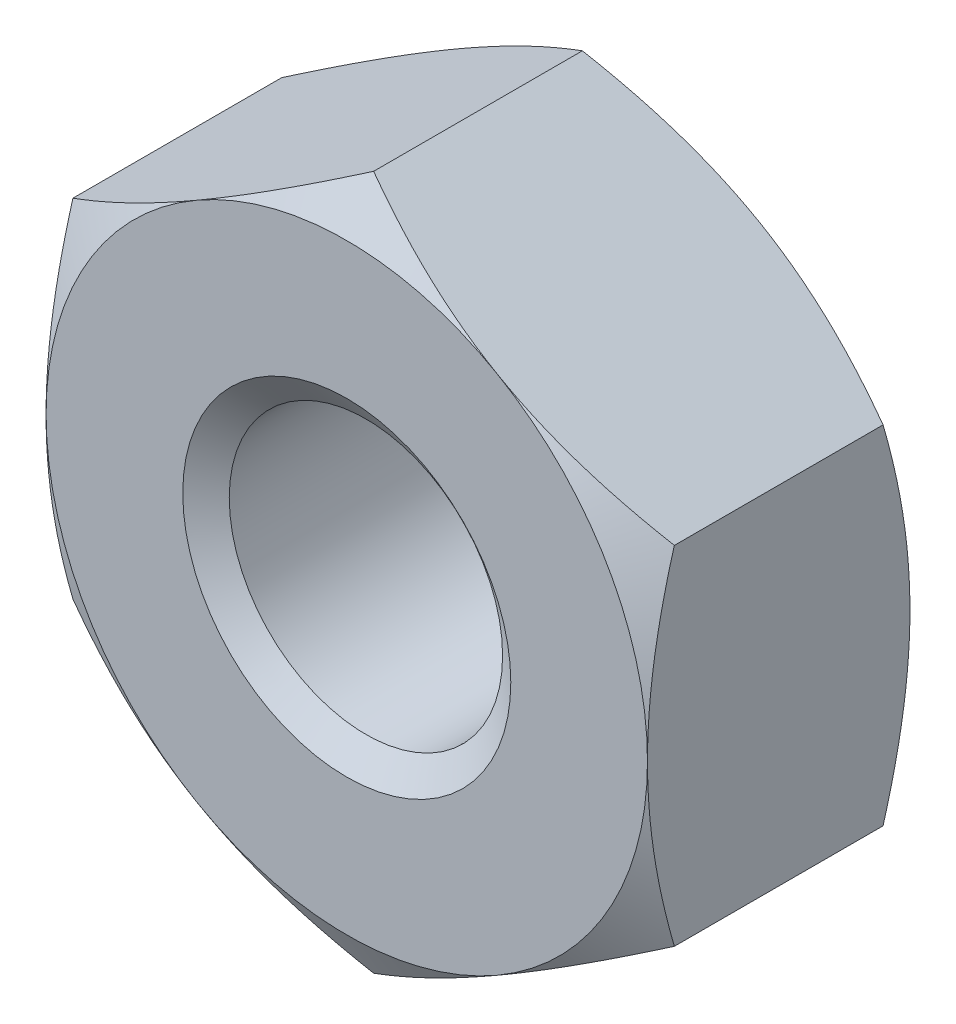
ISO-10303-21;
HEADER;
FILE_DESCRIPTION(('STEP AP214'),'2;1');
FILE_NAME('part.step','',(''),(''),'','','');
FILE_SCHEMA(('AUTOMOTIVE_DESIGN { 1 0 10303 214 1 1 1 1 }'));
ENDSEC;
DATA;
#1=APPLICATION_CONTEXT('core data for automotive mechanical design processes');
#2=APPLICATION_PROTOCOL_DEFINITION('international standard','automotive_design',2000,#1);
#3=PRODUCT_CONTEXT('',#1,'mechanical');
#4=PRODUCT('Part','Part','',(#3));
#5=PRODUCT_RELATED_PRODUCT_CATEGORY('part','',(#4));
#6=PRODUCT_DEFINITION_FORMATION('','',#4);
#7=PRODUCT_DEFINITION_CONTEXT('part definition',#1,'design');
#8=PRODUCT_DEFINITION('design','',#6,#7);
#9=PRODUCT_DEFINITION_SHAPE('','',#8);
#10=(LENGTH_UNIT() NAMED_UNIT(*) SI_UNIT(.MILLI.,.METRE.));
#11=(NAMED_UNIT(*) PLANE_ANGLE_UNIT() SI_UNIT($,.RADIAN.));
#12=(NAMED_UNIT(*) SI_UNIT($,.STERADIAN.) SOLID_ANGLE_UNIT());
#13=UNCERTAINTY_MEASURE_WITH_UNIT(LENGTH_MEASURE(1.E-05),#10,'distance_accuracy_value','');
#14=(GEOMETRIC_REPRESENTATION_CONTEXT(3) GLOBAL_UNCERTAINTY_ASSIGNED_CONTEXT((#13)) GLOBAL_UNIT_ASSIGNED_CONTEXT((#10,
#11,#12)) REPRESENTATION_CONTEXT('',''));
#15=CARTESIAN_POINT('',(0.,0.,0.));
#16=DIRECTION('',(0.,0.,1.));
#17=DIRECTION('',(1.,0.,0.));
#18=AXIS2_PLACEMENT_3D('',#15,#16,#17);
#19=CARTESIAN_POINT('',(0.,0.,-2.4));
#20=DIRECTION('',(0.,0.,1.));
#21=DIRECTION('',(1.,0.,0.));
#22=AXIS2_PLACEMENT_3D('',#19,#20,#21);
#23=CYLINDRICAL_SURFACE('',#22,1.25);
#24=CARTESIAN_POINT('',(0.,0.,-0.175051884552423));
#25=DIRECTION('',(0.,0.,1.));
#26=DIRECTION('',(1.,0.,0.));
#27=AXIS2_PLACEMENT_3D('',#24,#25,#26);
#28=CIRCLE('',#27,1.25);
#29=CARTESIAN_POINT('',(1.25,0.,-0.175051884552423));
#30=VERTEX_POINT('',#29);
#31=EDGE_CURVE('E170',#30,#30,#28,.F.);
#32=ORIENTED_EDGE('',*,*,#31,.F.);
#33=EDGE_LOOP('',(#32));
#34=FACE_BOUND('',#33,.T.);
#35=CARTESIAN_POINT('',(0.,0.,-2.19954811544758));
#36=DIRECTION('',(0.,0.,-1.));
#37=DIRECTION('',(-1.,0.,0.));
#38=AXIS2_PLACEMENT_3D('',#35,#36,#37);
#39=CIRCLE('',#38,1.25);
#40=CARTESIAN_POINT('',(-1.25,0.,-2.19954811544758));
#41=VERTEX_POINT('',#40);
#42=EDGE_CURVE('E35',#41,#41,#39,.F.);
#43=ORIENTED_EDGE('',*,*,#42,.F.);
#44=EDGE_LOOP('',(#43));
#45=FACE_BOUND('',#44,.T.);
#46=ADVANCED_FACE('F30',(#34,#45),#23,.F.);
#47=CARTESIAN_POINT('',(0.,3.17542648054295,-2.4));
#48=DIRECTION('',(0.,0.,-1.));
#49=DIRECTION('',(-1.,0.,0.));
#50=AXIS2_PLACEMENT_3D('',#47,#48,#49);
#51=PLANE('',#50);
#52=CARTESIAN_POINT('',(0.,0.,-2.4));
#53=DIRECTION('',(0.,0.,-1.));
#54=DIRECTION('',(-1.,0.,0.));
#55=AXIS2_PLACEMENT_3D('',#52,#53,#54);
#56=CIRCLE('',#55,2.75);
#57=CARTESIAN_POINT('',(-2.75,0.,-2.4));
#58=VERTEX_POINT('',#57);
#59=CARTESIAN_POINT('',(-1.37500000000002,-2.3815698604072,-2.4));
#60=VERTEX_POINT('',#59);
#61=EDGE_CURVE('E166',#58,#60,#56,.F.);
#62=ORIENTED_EDGE('',*,*,#61,.F.);
#63=CARTESIAN_POINT('',(-1.37500000000001,2.3815698604072,-2.4));
#64=VERTEX_POINT('',#63);
#65=EDGE_CURVE('E148',#64,#58,#56,.F.);
#66=ORIENTED_EDGE('',*,*,#65,.F.);
#67=CARTESIAN_POINT('',(1.37500000000002,2.38156986040719,-2.4));
#68=VERTEX_POINT('',#67);
#69=EDGE_CURVE('E165',#68,#64,#56,.F.);
#70=ORIENTED_EDGE('',*,*,#69,.F.);
#71=CARTESIAN_POINT('',(0.,0.,-2.4));
#72=DIRECTION('',(0.,0.,1.));
#73=DIRECTION('',(1.,0.,0.));
#74=AXIS2_PLACEMENT_3D('',#71,#72,#73);
#75=CIRCLE('',#74,2.75);
#76=CARTESIAN_POINT('',(2.75,0.,-2.4));
#77=VERTEX_POINT('',#76);
#78=EDGE_CURVE('E240',#77,#68,#75,.T.);
#79=ORIENTED_EDGE('',*,*,#78,.F.);
#80=CARTESIAN_POINT('',(1.375,-2.3815698604072,-2.4));
#81=VERTEX_POINT('',#80);
#82=EDGE_CURVE('E356',#81,#77,#56,.F.);
#83=ORIENTED_EDGE('',*,*,#82,.F.);
#84=EDGE_CURVE('E360',#60,#81,#56,.F.);
#85=ORIENTED_EDGE('',*,*,#84,.F.);
#86=EDGE_LOOP('',(#62,#66,#70,#79,#83,#85));
#87=FACE_BOUND('',#86,.T.);
#88=CARTESIAN_POINT('',(0.,0.,-2.4));
#89=DIRECTION('',(0.,0.,-1.));
#90=DIRECTION('',(-1.,0.,0.));
#91=AXIS2_PLACEMENT_3D('',#88,#89,#90);
#92=CIRCLE('',#91,1.5);
#93=CARTESIAN_POINT('',(-1.5,0.,-2.4));
#94=VERTEX_POINT('',#93);
#95=EDGE_CURVE('E173',#94,#94,#92,.F.);
#96=ORIENTED_EDGE('',*,*,#95,.T.);
#97=EDGE_LOOP('',(#96));
#98=FACE_BOUND('',#97,.T.);
#99=ADVANCED_FACE('F293',(#87,#98),#51,.T.);
#100=CARTESIAN_POINT('',(0.,3.17542648054295,0.));
#101=DIRECTION('',(0.,0.,-1.));
#102=DIRECTION('',(-1.,0.,0.));
#103=AXIS2_PLACEMENT_3D('',#100,#101,#102);
#104=PLANE('',#103);
#105=CARTESIAN_POINT('',(0.,0.,0.));
#106=DIRECTION('',(0.,0.,-1.));
#107=DIRECTION('',(-1.,0.,0.));
#108=AXIS2_PLACEMENT_3D('',#105,#106,#107);
#109=CIRCLE('',#108,2.75);
#110=CARTESIAN_POINT('',(-2.75,0.,0.));
#111=VERTEX_POINT('',#110);
#112=CARTESIAN_POINT('',(-1.37500000000001,2.3815698604072,0.));
#113=VERTEX_POINT('',#112);
#114=EDGE_CURVE('E11',#111,#113,#109,.T.);
#115=ORIENTED_EDGE('',*,*,#114,.F.);
#116=CARTESIAN_POINT('',(-1.37500000000002,-2.3815698604072,0.));
#117=VERTEX_POINT('',#116);
#118=EDGE_CURVE('E42',#117,#111,#109,.T.);
#119=ORIENTED_EDGE('',*,*,#118,.F.);
#120=CARTESIAN_POINT('',(1.375,-2.3815698604072,0.));
#121=VERTEX_POINT('',#120);
#122=EDGE_CURVE('E169',#121,#117,#109,.T.);
#123=ORIENTED_EDGE('',*,*,#122,.F.);
#124=CARTESIAN_POINT('',(2.75,0.,0.));
#125=VERTEX_POINT('',#124);
#126=EDGE_CURVE('E347',#125,#121,#109,.T.);
#127=ORIENTED_EDGE('',*,*,#126,.F.);
#128=CARTESIAN_POINT('',(0.,0.,0.));
#129=DIRECTION('',(0.,0.,1.));
#130=DIRECTION('',(1.,0.,0.));
#131=AXIS2_PLACEMENT_3D('',#128,#129,#130);
#132=CIRCLE('',#131,2.75);
#133=CARTESIAN_POINT('',(1.37500000000002,2.38156986040719,0.));
#134=VERTEX_POINT('',#133);
#135=EDGE_CURVE('E124',#125,#134,#132,.T.);
#136=ORIENTED_EDGE('',*,*,#135,.T.);
#137=EDGE_CURVE('E40',#113,#134,#109,.T.);
#138=ORIENTED_EDGE('',*,*,#137,.F.);
#139=EDGE_LOOP('',(#115,#119,#123,#127,#136,#138));
#140=FACE_BOUND('',#139,.T.);
#141=CARTESIAN_POINT('',(0.,0.,0.));
#142=DIRECTION('',(0.,0.,1.));
#143=DIRECTION('',(1.,0.,0.));
#144=AXIS2_PLACEMENT_3D('',#141,#142,#143);
#145=CIRCLE('',#144,1.5);
#146=CARTESIAN_POINT('',(1.5,0.,0.));
#147=VERTEX_POINT('',#146);
#148=EDGE_CURVE('E172',#147,#147,#145,.T.);
#149=ORIENTED_EDGE('',*,*,#148,.F.);
#150=EDGE_LOOP('',(#149));
#151=FACE_BOUND('',#150,.T.);
#152=ADVANCED_FACE('F245',(#140,#151),#104,.F.);
#153=CARTESIAN_POINT('',(0.,3.17542648054295,-2.4));
#154=DIRECTION('',(-0.500000000000004,0.866025403784436,0.));
#155=DIRECTION('',(-0.866025403784437,-0.500000000000004,0.));
#156=AXIS2_PLACEMENT_3D('',#153,#154,#155);
#157=PLANE('',#156);
#158=DIRECTION('',(0.,0.,1.));
#159=VECTOR('',#158,1.);
#160=CARTESIAN_POINT('',(-2.75,1.58771324027146,-2.4));
#161=LINE('',#160,#159);
#162=CARTESIAN_POINT('',(-2.75,1.58771324027149,-2.15437990693813));
#163=VERTEX_POINT('',#162);
#164=CARTESIAN_POINT('',(-2.75,1.58771324027146,-0.24562009306186));
#165=VERTEX_POINT('',#164);
#166=EDGE_CURVE('E160',#163,#165,#161,.T.);
#167=ORIENTED_EDGE('',*,*,#166,.T.);
#168=CARTESIAN_POINT('',(-2.7502,1.58759777021762,-0.245686763364758));
#169=CARTESIAN_POINT('',(-2.62935077934009,1.65737010029698,-0.205387662249261));
#170=CARTESIAN_POINT('',(-2.50745839737737,1.72774469983532,-0.16873690259766));
#171=CARTESIAN_POINT('',(-2.26156287327211,1.86971254687002,-0.104762182969798));
#172=CARTESIAN_POINT('',(-2.13755536142615,1.94130831721582,-0.0774608556744949));
#173=CARTESIAN_POINT('',(-1.89107720202406,2.08361254889598,-0.0349617452941145));
#174=CARTESIAN_POINT('',(-1.76864448141259,2.15429911309863,-0.0194811186224557));
#175=CARTESIAN_POINT('',(-1.52320285763109,2.29600490065922,-0.00099939736993867));
#176=CARTESIAN_POINT('',(-1.40019484676709,2.36702360884403,0.00201700053740198));
#177=CARTESIAN_POINT('',(-1.17034121338921,2.49972966594897,-0.0042531454285454));
#178=CARTESIAN_POINT('',(-1.06346120874598,2.56143686540072,-0.0120001542767015));
#179=CARTESIAN_POINT('',(-0.85039753266525,2.68444923614047,-0.0365551810643548));
#180=CARTESIAN_POINT('',(-0.744214598351109,2.74575398185008,-0.0533715896505709));
#181=CARTESIAN_POINT('',(-0.530711510606813,2.86902004703207,-0.0954119223459583));
#182=CARTESIAN_POINT('',(-0.42341838385714,2.93096576264319,-0.120814080687234));
#183=CARTESIAN_POINT('',(-0.210432520715942,3.05393320806134,-0.178467225839987));
#184=CARTESIAN_POINT('',(-0.104737054973339,3.11495651365996,-0.210704663298988));
#185=CARTESIAN_POINT('',(0.000200000000008958,3.17554195059679,-0.245686763364767));
#186=B_SPLINE_CURVE_WITH_KNOTS('',3,(#168,#169,#170,#171,#172,#173,#174,#175,#176,#177,#178,
#179,#180,#181,#182,#183,#184,#185),.UNSPECIFIED.,.F.,.F.,(4,2,2,2,2,2,2,2,4),(0.,
0.435912828725888,0.872873557116331,1.29901931904671,1.72464171213573,2.09526089052938,
2.46622354066375,2.84541551798559,3.22386274754526),.UNSPECIFIED.);
#187=EDGE_CURVE('E129',#165,#113,#186,.T.);
#188=ORIENTED_EDGE('',*,*,#187,.T.);
#189=CARTESIAN_POINT('',(0.,3.17542648054295,-0.245620093061869));
#190=VERTEX_POINT('',#189);
#191=EDGE_CURVE('E49',#113,#190,#186,.T.);
#192=ORIENTED_EDGE('',*,*,#191,.T.);
#193=DIRECTION('',(0.,0.,1.));
#194=VECTOR('',#193,1.);
#195=CARTESIAN_POINT('',(0.,3.17542648054295,-2.4));
#196=LINE('',#195,#194);
#197=CARTESIAN_POINT('',(0.,3.17542648054295,-2.15437990693813));
#198=VERTEX_POINT('',#197);
#199=EDGE_CURVE('E145',#198,#190,#196,.T.);
#200=ORIENTED_EDGE('',*,*,#199,.F.);
#201=CARTESIAN_POINT('',(-2.7502,1.58759777021762,-2.15431323663524));
#202=CARTESIAN_POINT('',(-2.62935077934009,1.65737010029698,-2.19461233775074));
#203=CARTESIAN_POINT('',(-2.50745839737737,1.72774469983532,-2.23126309740234));
#204=CARTESIAN_POINT('',(-2.26156287327211,1.86971254687002,-2.2952378170302));
#205=CARTESIAN_POINT('',(-2.13755536142615,1.94130831721582,-2.3225391443255));
#206=CARTESIAN_POINT('',(-1.89107720202406,2.08361254889598,-2.36503825470589));
#207=CARTESIAN_POINT('',(-1.76864448141259,2.15429911309863,-2.38051888137754));
#208=CARTESIAN_POINT('',(-1.52320285763109,2.29600490065922,-2.39900060263006));
#209=CARTESIAN_POINT('',(-1.40019484676709,2.36702360884403,-2.4020170005374));
#210=CARTESIAN_POINT('',(-1.17034121338921,2.49972966594897,-2.39574685457145));
#211=CARTESIAN_POINT('',(-1.06346120874598,2.56143686540072,-2.3879998457233));
#212=CARTESIAN_POINT('',(-0.85039753266525,2.68444923614047,-2.36344481893564));
#213=CARTESIAN_POINT('',(-0.744214598351109,2.74575398185008,-2.34662841034943));
#214=CARTESIAN_POINT('',(-0.530711510606812,2.86902004703207,-2.30458807765404));
#215=CARTESIAN_POINT('',(-0.42341838385714,2.93096576264319,-2.27918591931277));
#216=CARTESIAN_POINT('',(-0.210432520715942,3.05393320806134,-2.22153277416001));
#217=CARTESIAN_POINT('',(-0.104737054973339,3.11495651365996,-2.18929533670101));
#218=CARTESIAN_POINT('',(0.000200000000008958,3.17554195059679,-2.15431323663523));
#219=B_SPLINE_CURVE_WITH_KNOTS('',3,(#201,#202,#203,#204,#205,#206,#207,#208,#209,#210,#211,
#212,#213,#214,#215,#216,#217,#218),.UNSPECIFIED.,.F.,.F.,(4,2,2,2,2,2,2,2,4),(0.,
0.435912828725888,0.872873557116331,1.29901931904671,1.72464171213573,2.09526089052938,
2.46622354066375,2.84541551798559,3.22386274754526),.UNSPECIFIED.);
#220=EDGE_CURVE('E163',#64,#198,#219,.T.);
#221=ORIENTED_EDGE('',*,*,#220,.F.);
#222=EDGE_CURVE('E255',#163,#64,#219,.T.);
#223=ORIENTED_EDGE('',*,*,#222,.F.);
#224=EDGE_LOOP('',(#167,#188,#192,#200,#221,#223));
#225=FACE_BOUND('',#224,.T.);
#226=ADVANCED_FACE('F32',(#225),#157,.T.);
#227=CARTESIAN_POINT('',(2.75,1.58771324027145,-2.4));
#228=DIRECTION('',(0.500000000000009,0.866025403784433,0.));
#229=DIRECTION('',(-0.866025403784434,0.500000000000009,0.));
#230=AXIS2_PLACEMENT_3D('',#227,#228,#229);
#231=PLANE('',#230);
#232=ORIENTED_EDGE('',*,*,#199,.T.);
#233=CARTESIAN_POINT('',(-0.000199999999990853,3.17554195059679,-0.245686763364767));
#234=CARTESIAN_POINT('',(0.120649220659915,3.10576962051744,-0.20538766224927));
#235=CARTESIAN_POINT('',(0.242541602622642,3.03539502097909,-0.168736902597668));
#236=CARTESIAN_POINT('',(0.4884371267279,2.89342717394439,-0.104762182969804));
#237=CARTESIAN_POINT('',(0.612444638573863,2.82183140359859,-0.0774608556744999));
#238=CARTESIAN_POINT('',(0.85892279797595,2.67952717191842,-0.0349617452941177));
#239=CARTESIAN_POINT('',(0.981355518587424,2.60884060771577,-0.0194811186224581));
#240=CARTESIAN_POINT('',(1.22679714236892,2.46713482015518,-0.000999397369939279));
#241=CARTESIAN_POINT('',(1.34980515323292,2.39611611197037,0.00201700053740233));
#242=CARTESIAN_POINT('',(1.5796587866108,2.26341005486543,-0.00425314542854367));
#243=CARTESIAN_POINT('',(1.68653879125403,2.20170285541368,-0.0120001542766991));
#244=CARTESIAN_POINT('',(1.89960246733475,2.07869048467393,-0.036555181064351));
#245=CARTESIAN_POINT('',(2.00578540164889,2.01738573896432,-0.0533715896505663));
#246=CARTESIAN_POINT('',(2.21928848939319,1.89411967378233,-0.0954119223459519));
#247=CARTESIAN_POINT('',(2.32658161614286,1.83217395817121,-0.120814080687226));
#248=CARTESIAN_POINT('',(2.53956747928405,1.70920651275305,-0.178467225839977));
#249=CARTESIAN_POINT('',(2.64526294502666,1.64818320715444,-0.210704663298978));
#250=CARTESIAN_POINT('',(2.7502,1.58759777021761,-0.245686763364756));
#251=B_SPLINE_CURVE_WITH_KNOTS('',3,(#233,#234,#235,#236,#237,#238,#239,#240,#241,#242,#243,
#244,#245,#246,#247,#248,#249,#250),.UNSPECIFIED.,.F.,.F.,(4,2,2,2,2,2,2,2,4),(0.,
0.43591282872589,0.872873557116336,1.29901931904672,1.72464171213574,2.09526089052938,
2.46622354066375,2.84541551798558,3.22386274754526),.UNSPECIFIED.);
#252=EDGE_CURVE('E139',#190,#134,#251,.T.);
#253=ORIENTED_EDGE('',*,*,#252,.T.);
#254=CARTESIAN_POINT('',(2.75,1.58771324027149,-0.245620093061869));
#255=VERTEX_POINT('',#254);
#256=EDGE_CURVE('E56',#134,#255,#251,.T.);
#257=ORIENTED_EDGE('',*,*,#256,.T.);
#258=DIRECTION('',(0.,0.,1.));
#259=VECTOR('',#258,1.);
#260=CARTESIAN_POINT('',(2.75,1.58771324027145,-2.4));
#261=LINE('',#260,#259);
#262=CARTESIAN_POINT('',(2.75,1.58771324027149,-2.15437990693813));
#263=VERTEX_POINT('',#262);
#264=EDGE_CURVE('E138',#263,#255,#261,.T.);
#265=ORIENTED_EDGE('',*,*,#264,.F.);
#266=CARTESIAN_POINT('',(-0.000199999999990853,3.17554195059679,-2.15431323663523));
#267=CARTESIAN_POINT('',(0.120649220659915,3.10576962051743,-2.19461233775073));
#268=CARTESIAN_POINT('',(0.242541602622642,3.03539502097909,-2.23126309740233));
#269=CARTESIAN_POINT('',(0.4884371267279,2.89342717394439,-2.29523781703019));
#270=CARTESIAN_POINT('',(0.612444638573863,2.82183140359859,-2.3225391443255));
#271=CARTESIAN_POINT('',(0.85892279797595,2.67952717191842,-2.36503825470588));
#272=CARTESIAN_POINT('',(0.981355518587423,2.60884060771577,-2.38051888137754));
#273=CARTESIAN_POINT('',(1.22679714236892,2.46713482015518,-2.39900060263006));
#274=CARTESIAN_POINT('',(1.34980515323292,2.39611611197037,-2.4020170005374));
#275=CARTESIAN_POINT('',(1.5796587866108,2.26341005486543,-2.39574685457146));
#276=CARTESIAN_POINT('',(1.68653879125403,2.20170285541368,-2.3879998457233));
#277=CARTESIAN_POINT('',(1.89960246733475,2.07869048467393,-2.36344481893565));
#278=CARTESIAN_POINT('',(2.00578540164889,2.01738573896432,-2.34662841034943));
#279=CARTESIAN_POINT('',(2.21928848939319,1.89411967378233,-2.30458807765405));
#280=CARTESIAN_POINT('',(2.32658161614286,1.83217395817121,-2.27918591931277));
#281=CARTESIAN_POINT('',(2.53956747928405,1.70920651275305,-2.22153277416002));
#282=CARTESIAN_POINT('',(2.64526294502666,1.64818320715444,-2.18929533670102));
#283=CARTESIAN_POINT('',(2.7502,1.58759777021761,-2.15431323663524));
#284=B_SPLINE_CURVE_WITH_KNOTS('',3,(#266,#267,#268,#269,#270,#271,#272,#273,#274,#275,#276,
#277,#278,#279,#280,#281,#282,#283),.UNSPECIFIED.,.F.,.F.,(4,2,2,2,2,2,2,2,4),(0.,
0.43591282872589,0.872873557116335,1.29901931904672,1.72464171213574,2.09526089052938,
2.46622354066375,2.84541551798558,3.22386274754526),.UNSPECIFIED.);
#285=EDGE_CURVE('E249',#68,#263,#284,.T.);
#286=ORIENTED_EDGE('',*,*,#285,.F.);
#287=EDGE_CURVE('E254',#198,#68,#284,.T.);
#288=ORIENTED_EDGE('',*,*,#287,.F.);
#289=EDGE_LOOP('',(#232,#253,#257,#265,#286,#288));
#290=FACE_BOUND('',#289,.T.);
#291=ADVANCED_FACE('F136',(#290),#231,.T.);
#292=CARTESIAN_POINT('',(2.75,1.58771324027145,-2.4));
#293=DIRECTION('',(-1.,0.,0.));
#294=DIRECTION('',(0.,0.,1.));
#295=AXIS2_PLACEMENT_3D('',#292,#293,#294);
#296=PLANE('',#295);
#297=CARTESIAN_POINT('',(2.75,-4.2108494930968,-1.31594843960296));
#298=CARTESIAN_POINT('',(2.75,-4.09010894214094,-1.25759993615226));
#299=CARTESIAN_POINT('',(2.75,-3.96908292065513,-1.19983146511761));
#300=CARTESIAN_POINT('',(2.75,-3.72630558284848,-1.08578603842307));
#301=CARTESIAN_POINT('',(2.75,-3.60455414536204,-1.02950934100249));
#302=CARTESIAN_POINT('',(2.75,-3.35951393034358,-0.918482443352777));
#303=CARTESIAN_POINT('',(2.75,-3.2362203423644,-0.863742821605857));
#304=CARTESIAN_POINT('',(2.75,-2.98861980138747,-0.756614777476472));
#305=CARTESIAN_POINT('',(2.75,-2.86431290161186,-0.704226232536781));
#306=CARTESIAN_POINT('',(2.75,-2.61294485887176,-0.60180357214614));
#307=CARTESIAN_POINT('',(2.75,-2.48586863815658,-0.55180625789841));
#308=CARTESIAN_POINT('',(2.75,-2.23021732171544,-0.455727408784616));
#309=CARTESIAN_POINT('',(2.75,-2.10164206103367,-0.409646309576985));
#310=CARTESIAN_POINT('',(2.75,-1.8430521879947,-0.322638077046244));
#311=CARTESIAN_POINT('',(2.75,-1.71304130052587,-0.2816999864139));
#312=CARTESIAN_POINT('',(2.75,-1.45117125062151,-0.206307307624358));
#313=CARTESIAN_POINT('',(2.75,-1.31931268690205,-0.171850669152777));
#314=CARTESIAN_POINT('',(2.75,-1.05365722480015,-0.111093671530912));
#315=CARTESIAN_POINT('',(2.75,-0.91985982021762,-0.0847954840951284));
#316=CARTESIAN_POINT('',(2.75,-0.650651874037408,-0.0421260371966166));
#317=CARTESIAN_POINT('',(2.75,-0.515241331013621,-0.0257547865105478));
#318=CARTESIAN_POINT('',(2.75,-0.244373242869235,-0.00438749654024077));
#319=CARTESIAN_POINT('',(2.75,-0.108921526377157,0.000680556773213337));
#320=CARTESIAN_POINT('',(2.75,0.161887058855111,-0.000827795632673392));
#321=CARTESIAN_POINT('',(2.75,0.297243943089618,-0.00740117868555455));
#322=CARTESIAN_POINT('',(2.75,0.528385436717519,-0.0281041300468435));
#323=CARTESIAN_POINT('',(2.75,0.624425050137477,-0.0395376410301872));
#324=CARTESIAN_POINT('',(2.75,0.815762399811518,-0.0675217196133488));
#325=CARTESIAN_POINT('',(2.75,0.911060016631939,-0.0840730942276795));
#326=CARTESIAN_POINT('',(2.75,1.19576218748913,-0.14053536127828));
#327=CARTESIAN_POINT('',(2.75,1.38383224738493,-0.187239859417288));
#328=CARTESIAN_POINT('',(2.75,1.66525048947482,-0.26779249703057));
#329=CARTESIAN_POINT('',(2.75,1.76006556248554,-0.296803334995492));
#330=CARTESIAN_POINT('',(2.75,1.94870609382212,-0.357695648906578));
#331=CARTESIAN_POINT('',(2.75,2.04253218553692,-0.389575144878493));
#332=CARTESIAN_POINT('',(2.75,2.22880240354981,-0.455541418186437));
#333=CARTESIAN_POINT('',(2.75,2.32125133588448,-0.489614761455521));
#334=CARTESIAN_POINT('',(2.75,2.50543192042625,-0.559761368231096));
#335=CARTESIAN_POINT('',(2.75,2.59716326539575,-0.595835440037304));
#336=CARTESIAN_POINT('',(2.75,2.68856293053342,-0.63271244199747));
#337=B_SPLINE_CURVE_WITH_KNOTS('',3,(#297,#298,#299,#300,#301,#302,#303,#304,#305,#306,#307,
#308,#309,#310,#311,#312,#313,#314,#315,#316,#317,#318,#319,#320,#321,#322,#323,#324,#325,#326,
#327,#328,#329,#330,#331,#332,#333,#334,#335,#336),.UNSPECIFIED.,.F.,.F.,(4,2,2,2,2,2,2,2,2,2,2,
2,2,2,2,2,2,2,2,4),(0.,0.402305607365937,0.804680408536998,1.20935783819118,1.61401414820819,
2.02363838185771,2.4333081245735,2.84208969479601,3.25074173456638,3.65950246109145,
4.06826354901186,4.47441284024652,4.88045669141174,5.17046846817548,5.46052599902454,
6.04107275309884,6.33851131304662,6.63574613017455,6.93130791005792,7.22698998004823),.UNSPECIFIED.);
#338=CARTESIAN_POINT('',(2.74999999999999,-1.58771324027152,-0.245620093061869));
#339=VERTEX_POINT('',#338);
#340=EDGE_CURVE('E131',#339,#125,#337,.T.);
#341=ORIENTED_EDGE('',*,*,#340,.F.);
#342=DIRECTION('',(0.,0.,1.));
#343=VECTOR('',#342,1.);
#344=CARTESIAN_POINT('',(2.75,-1.58771324027151,-2.4));
#345=LINE('',#344,#343);
#346=CARTESIAN_POINT('',(2.74999999999999,-1.58771324027152,-2.15437990693813));
#347=VERTEX_POINT('',#346);
#348=EDGE_CURVE('E146',#347,#339,#345,.T.);
#349=ORIENTED_EDGE('',*,*,#348,.F.);
#350=CARTESIAN_POINT('',(2.75,-4.2108494930968,-1.08405156039704));
#351=CARTESIAN_POINT('',(2.75,-4.09010894214094,-1.14240006384774));
#352=CARTESIAN_POINT('',(2.75,-3.96908292065513,-1.20016853488239));
#353=CARTESIAN_POINT('',(2.75,-3.72630558284847,-1.31421396157693));
#354=CARTESIAN_POINT('',(2.75,-3.60455414536204,-1.37049065899751));
#355=CARTESIAN_POINT('',(2.75,-3.35951393034358,-1.48151755664722));
#356=CARTESIAN_POINT('',(2.75,-3.2362203423644,-1.53625717839414));
#357=CARTESIAN_POINT('',(2.75,-2.98861980138747,-1.64338522252353));
#358=CARTESIAN_POINT('',(2.75,-2.86431290161185,-1.69577376746322));
#359=CARTESIAN_POINT('',(2.75,-2.61294485887175,-1.79819642785386));
#360=CARTESIAN_POINT('',(2.75,-2.48586863815658,-1.84819374210159));
#361=CARTESIAN_POINT('',(2.75,-2.23021732171544,-1.94427259121538));
#362=CARTESIAN_POINT('',(2.75,-2.10164206103367,-1.99035369042301));
#363=CARTESIAN_POINT('',(2.75,-1.8430521879947,-2.07736192295376));
#364=CARTESIAN_POINT('',(2.75,-1.71304130052586,-2.1183000135861));
#365=CARTESIAN_POINT('',(2.75,-1.45117125062151,-2.19369269237564));
#366=CARTESIAN_POINT('',(2.75,-1.31931268690205,-2.22814933084722));
#367=CARTESIAN_POINT('',(2.75,-1.05365722480015,-2.28890632846909));
#368=CARTESIAN_POINT('',(2.75,-0.91985982021762,-2.31520451590487));
#369=CARTESIAN_POINT('',(2.75,-0.650651874037409,-2.35787396280338));
#370=CARTESIAN_POINT('',(2.75,-0.515241331013622,-2.37424521348945));
#371=CARTESIAN_POINT('',(2.75,-0.244373242869237,-2.39561250345976));
#372=CARTESIAN_POINT('',(2.75,-0.108921526377158,-2.40068055677321));
#373=CARTESIAN_POINT('',(2.75,0.161887058855111,-2.39917220436733));
#374=CARTESIAN_POINT('',(2.75,0.297243943089618,-2.39259882131444));
#375=CARTESIAN_POINT('',(2.75,0.52838543671752,-2.37189586995316));
#376=CARTESIAN_POINT('',(2.75,0.624425050137478,-2.36046235896981));
#377=CARTESIAN_POINT('',(2.75,0.815762399811519,-2.33247828038665));
#378=CARTESIAN_POINT('',(2.75,0.911060016631941,-2.31592690577232));
#379=CARTESIAN_POINT('',(2.75,1.19576218748914,-2.25946463872172));
#380=CARTESIAN_POINT('',(2.75,1.38383224738494,-2.21276014058271));
#381=CARTESIAN_POINT('',(2.75,1.66525048947482,-2.13220750296943));
#382=CARTESIAN_POINT('',(2.75,1.76006556248555,-2.10319666500451));
#383=CARTESIAN_POINT('',(2.75,1.94870609382212,-2.04230435109342));
#384=CARTESIAN_POINT('',(2.75,2.04253218553693,-2.01042485512151));
#385=CARTESIAN_POINT('',(2.75,2.22880240354981,-1.94445858181356));
#386=CARTESIAN_POINT('',(2.75,2.32125133588448,-1.91038523854448));
#387=CARTESIAN_POINT('',(2.75,2.50543192042625,-1.8402386317689));
#388=CARTESIAN_POINT('',(2.75,2.59716326539575,-1.80416455996269));
#389=CARTESIAN_POINT('',(2.75,2.68856293053342,-1.76728755800253));
#390=B_SPLINE_CURVE_WITH_KNOTS('',3,(#350,#351,#352,#353,#354,#355,#356,#357,#358,#359,#360,
#361,#362,#363,#364,#365,#366,#367,#368,#369,#370,#371,#372,#373,#374,#375,#376,#377,#378,#379,
#380,#381,#382,#383,#384,#385,#386,#387,#388,#389),.UNSPECIFIED.,.F.,.F.,(4,2,2,2,2,2,2,2,2,2,2,
2,2,2,2,2,2,2,2,4),(0.,0.402305607365938,0.804680408537001,1.20935783819118,1.61401414820819,
2.02363838185771,2.4333081245735,2.84208969479601,3.25074173456638,3.65950246109145,
4.06826354901185,4.47441284024652,4.88045669141174,5.17046846817548,5.46052599902454,
6.04107275309884,6.33851131304662,6.63574613017455,6.93130791005793,7.22698998004823),.UNSPECIFIED.);
#391=EDGE_CURVE('E261',#347,#77,#390,.T.);
#392=ORIENTED_EDGE('',*,*,#391,.T.);
#393=EDGE_CURVE('E144',#77,#263,#390,.T.);
#394=ORIENTED_EDGE('',*,*,#393,.T.);
#395=ORIENTED_EDGE('',*,*,#264,.T.);
#396=EDGE_CURVE('E121',#125,#255,#337,.T.);
#397=ORIENTED_EDGE('',*,*,#396,.F.);
#398=EDGE_LOOP('',(#341,#349,#392,#394,#395,#397));
#399=FACE_BOUND('',#398,.T.);
#400=ADVANCED_FACE('F142',(#399),#296,.F.);
#401=CARTESIAN_POINT('',(0.,-3.17542648054299,-2.4));
#402=DIRECTION('',(0.500000000000002,-0.866025403784438,0.));
#403=DIRECTION('',(0.866025403784438,0.500000000000002,0.));
#404=AXIS2_PLACEMENT_3D('',#401,#402,#403);
#405=PLANE('',#404);
#406=ORIENTED_EDGE('',*,*,#348,.T.);
#407=CARTESIAN_POINT('',(2.7502,-1.58759777021767,-0.245686763364773));
#408=CARTESIAN_POINT('',(2.6293507793401,-1.65737010029702,-0.205387662249276));
#409=CARTESIAN_POINT('',(2.50745839737737,-1.72774469983537,-0.168736902597675));
#410=CARTESIAN_POINT('',(2.26156287327211,-1.86971254687006,-0.104762182969815));
#411=CARTESIAN_POINT('',(2.13755536142614,-1.94130831721587,-0.077460855674512));
#412=CARTESIAN_POINT('',(1.89107720202405,-2.08361254889603,-0.0349617452941329));
#413=CARTESIAN_POINT('',(1.76864448141258,-2.15429911309868,-0.0194811186224747));
#414=CARTESIAN_POINT('',(1.52320285763108,-2.29600490065927,-0.000999397369959086));
#415=CARTESIAN_POINT('',(1.40019484676708,-2.36702360884408,0.00201700053738069));
#416=CARTESIAN_POINT('',(1.1703412133892,-2.49972966594901,-0.00425314542856813));
#417=CARTESIAN_POINT('',(1.06346120874597,-2.56143686540077,-0.0120001542767246));
#418=CARTESIAN_POINT('',(0.850397532665244,-2.68444923614051,-0.0365551810643784));
#419=CARTESIAN_POINT('',(0.744214598351105,-2.74575398185012,-0.0533715896505945));
#420=CARTESIAN_POINT('',(0.530711510606811,-2.86902004703211,-0.0954119223459816));
#421=CARTESIAN_POINT('',(0.423418383857141,-2.93096576264323,-0.120814080687257));
#422=CARTESIAN_POINT('',(0.210432520715946,-3.05393320806138,-0.178467225840008));
#423=CARTESIAN_POINT('',(0.104737054973345,-3.11495651366,-0.210704663299009));
#424=CARTESIAN_POINT('',(-0.000200000000002055,-3.17554195059682,-0.245686763364787));
#425=B_SPLINE_CURVE_WITH_KNOTS('',3,(#407,#408,#409,#410,#411,#412,#413,#414,#415,#416,#417,
#418,#419,#420,#421,#422,#423,#424),.UNSPECIFIED.,.F.,.F.,(4,2,2,2,2,2,2,2,4),(0.,
0.435912828725892,0.872873557116338,1.29901931904672,1.72464171213575,2.09526089052939,
2.46622354066375,2.84541551798558,3.22386274754525),.UNSPECIFIED.);
#426=EDGE_CURVE('E342',#339,#121,#425,.T.);
#427=ORIENTED_EDGE('',*,*,#426,.T.);
#428=CARTESIAN_POINT('',(0.,-3.17542648054295,-0.245620093061869));
#429=VERTEX_POINT('',#428);
#430=EDGE_CURVE('E221',#121,#429,#425,.T.);
#431=ORIENTED_EDGE('',*,*,#430,.T.);
#432=DIRECTION('',(0.,0.,1.));
#433=VECTOR('',#432,1.);
#434=CARTESIAN_POINT('',(0.,-3.17542648054299,-2.4));
#435=LINE('',#434,#433);
#436=CARTESIAN_POINT('',(0.,-3.17542648054295,-2.15437990693813));
#437=VERTEX_POINT('',#436);
#438=EDGE_CURVE('E151',#437,#429,#435,.T.);
#439=ORIENTED_EDGE('',*,*,#438,.F.);
#440=CARTESIAN_POINT('',(2.7502,-1.58759777021767,-2.15431323663523));
#441=CARTESIAN_POINT('',(2.6293507793401,-1.65737010029702,-2.19461233775072));
#442=CARTESIAN_POINT('',(2.50745839737737,-1.72774469983537,-2.23126309740232));
#443=CARTESIAN_POINT('',(2.26156287327211,-1.86971254687006,-2.29523781703018));
#444=CARTESIAN_POINT('',(2.13755536142614,-1.94130831721587,-2.32253914432549));
#445=CARTESIAN_POINT('',(1.89107720202405,-2.08361254889603,-2.36503825470587));
#446=CARTESIAN_POINT('',(1.76864448141258,-2.15429911309868,-2.38051888137752));
#447=CARTESIAN_POINT('',(1.52320285763108,-2.29600490065927,-2.39900060263004));
#448=CARTESIAN_POINT('',(1.40019484676708,-2.36702360884408,-2.40201700053738));
#449=CARTESIAN_POINT('',(1.1703412133892,-2.49972966594901,-2.39574685457143));
#450=CARTESIAN_POINT('',(1.06346120874597,-2.56143686540077,-2.38799984572327));
#451=CARTESIAN_POINT('',(0.850397532665244,-2.68444923614051,-2.36344481893562));
#452=CARTESIAN_POINT('',(0.744214598351105,-2.74575398185012,-2.34662841034941));
#453=CARTESIAN_POINT('',(0.530711510606811,-2.86902004703211,-2.30458807765402));
#454=CARTESIAN_POINT('',(0.42341838385714,-2.93096576264323,-2.27918591931274));
#455=CARTESIAN_POINT('',(0.210432520715946,-3.05393320806138,-2.22153277415999));
#456=CARTESIAN_POINT('',(0.104737054973345,-3.11495651366,-2.18929533670099));
#457=CARTESIAN_POINT('',(-0.000200000000002054,-3.17554195059682,-2.15431323663521));
#458=B_SPLINE_CURVE_WITH_KNOTS('',3,(#440,#441,#442,#443,#444,#445,#446,#447,#448,#449,#450,
#451,#452,#453,#454,#455,#456,#457),.UNSPECIFIED.,.F.,.F.,(4,2,2,2,2,2,2,2,4),(0.,
0.435912828725892,0.872873557116339,1.29901931904673,1.72464171213575,2.09526089052939,
2.46622354066375,2.84541551798558,3.22386274754525),.UNSPECIFIED.);
#459=EDGE_CURVE('E267',#81,#437,#458,.T.);
#460=ORIENTED_EDGE('',*,*,#459,.F.);
#461=EDGE_CURVE('E266',#347,#81,#458,.T.);
#462=ORIENTED_EDGE('',*,*,#461,.F.);
#463=EDGE_LOOP('',(#406,#427,#431,#439,#460,#462));
#464=FACE_BOUND('',#463,.T.);
#465=ADVANCED_FACE('F277',(#464),#405,.T.);
#466=CARTESIAN_POINT('',(-2.75,-1.58771324027149,-2.4));
#467=DIRECTION('',(-0.500000000000006,-0.866025403784435,0.));
#468=DIRECTION('',(0.866025403784435,-0.500000000000006,0.));
#469=AXIS2_PLACEMENT_3D('',#466,#467,#468);
#470=PLANE('',#469);
#471=ORIENTED_EDGE('',*,*,#438,.T.);
#472=CARTESIAN_POINT('',(0.000199999999997729,-3.17554195059682,-0.245686763364787));
#473=CARTESIAN_POINT('',(-0.120649220659909,-3.10576962051747,-0.205387662249289));
#474=CARTESIAN_POINT('',(-0.242541602622638,-3.03539502097912,-0.168736902597687));
#475=CARTESIAN_POINT('',(-0.4884371267279,-2.89342717394442,-0.104762182969823));
#476=CARTESIAN_POINT('',(-0.612444638573864,-2.82183140359862,-0.0774608556745189));
#477=CARTESIAN_POINT('',(-0.858922797975955,-2.67952717191846,-0.0349617452941365));
#478=CARTESIAN_POINT('',(-0.981355518587429,-2.6088406077158,-0.0194811186224765));
#479=CARTESIAN_POINT('',(-1.22679714236893,-2.46713482015521,-0.000999397369957655));
#480=CARTESIAN_POINT('',(-1.34980515323293,-2.3961161119704,0.00201700053738368));
#481=CARTESIAN_POINT('',(-1.57965878661081,-2.26341005486546,-0.00425314542856249));
#482=CARTESIAN_POINT('',(-1.68653879125404,-2.20170285541371,-0.0120001542767176));
#483=CARTESIAN_POINT('',(-1.89960246733476,-2.07869048467397,-0.0365551810643686));
#484=CARTESIAN_POINT('',(-2.0057854016489,-2.01738573896436,-0.0533715896505833));
#485=CARTESIAN_POINT('',(-2.21928848939319,-1.89411967378237,-0.0954119223459676));
#486=CARTESIAN_POINT('',(-2.32658161614286,-1.83217395817125,-0.120814080687241));
#487=CARTESIAN_POINT('',(-2.53956747928405,-1.7092065127531,-0.178467225839991));
#488=CARTESIAN_POINT('',(-2.64526294502665,-1.64818320715448,-0.21070466329899));
#489=CARTESIAN_POINT('',(-2.7502,-1.58759777021765,-0.245686763364767));
#490=B_SPLINE_CURVE_WITH_KNOTS('',3,(#472,#473,#474,#475,#476,#477,#478,#479,#480,#481,#482,
#483,#484,#485,#486,#487,#488,#489),.UNSPECIFIED.,.F.,.F.,(4,2,2,2,2,2,2,2,4),(0.,
0.435912828725895,0.872873557116345,1.29901931904673,1.72464171213576,2.0952608905294,
2.46622354066376,2.84541551798559,3.22386274754525),.UNSPECIFIED.);
#491=EDGE_CURVE('E340',#429,#117,#490,.T.);
#492=ORIENTED_EDGE('',*,*,#491,.T.);
#493=CARTESIAN_POINT('',(-2.75,-1.58771324027149,-0.245620093061869));
#494=VERTEX_POINT('',#493);
#495=EDGE_CURVE('E195',#117,#494,#490,.T.);
#496=ORIENTED_EDGE('',*,*,#495,.T.);
#497=DIRECTION('',(0.,0.,1.));
#498=VECTOR('',#497,1.);
#499=CARTESIAN_POINT('',(-2.75,-1.58771324027149,-2.4));
#500=LINE('',#499,#498);
#501=CARTESIAN_POINT('',(-2.75,-1.58771324027149,-2.15437990693813));
#502=VERTEX_POINT('',#501);
#503=EDGE_CURVE('E157',#502,#494,#500,.T.);
#504=ORIENTED_EDGE('',*,*,#503,.F.);
#505=CARTESIAN_POINT('',(0.000199999999997729,-3.17554195059682,-2.15431323663521));
#506=CARTESIAN_POINT('',(-0.120649220659909,-3.10576962051747,-2.19461233775071));
#507=CARTESIAN_POINT('',(-0.242541602622638,-3.03539502097912,-2.23126309740231));
#508=CARTESIAN_POINT('',(-0.4884371267279,-2.89342717394442,-2.29523781703018));
#509=CARTESIAN_POINT('',(-0.612444638573864,-2.82183140359862,-2.32253914432548));
#510=CARTESIAN_POINT('',(-0.858922797975955,-2.67952717191846,-2.36503825470586));
#511=CARTESIAN_POINT('',(-0.981355518587429,-2.6088406077158,-2.38051888137752));
#512=CARTESIAN_POINT('',(-1.22679714236893,-2.46713482015521,-2.39900060263004));
#513=CARTESIAN_POINT('',(-1.34980515323293,-2.3961161119704,-2.40201700053738));
#514=CARTESIAN_POINT('',(-1.57965878661081,-2.26341005486546,-2.39574685457144));
#515=CARTESIAN_POINT('',(-1.68653879125404,-2.20170285541371,-2.38799984572328));
#516=CARTESIAN_POINT('',(-1.89960246733476,-2.07869048467397,-2.36344481893563));
#517=CARTESIAN_POINT('',(-2.0057854016489,-2.01738573896436,-2.34662841034942));
#518=CARTESIAN_POINT('',(-2.21928848939319,-1.89411967378237,-2.30458807765403));
#519=CARTESIAN_POINT('',(-2.32658161614286,-1.83217395817125,-2.27918591931276));
#520=CARTESIAN_POINT('',(-2.53956747928405,-1.7092065127531,-2.22153277416001));
#521=CARTESIAN_POINT('',(-2.64526294502665,-1.64818320715448,-2.18929533670101));
#522=CARTESIAN_POINT('',(-2.7502,-1.58759777021765,-2.15431323663523));
#523=B_SPLINE_CURVE_WITH_KNOTS('',3,(#505,#506,#507,#508,#509,#510,#511,#512,#513,#514,#515,
#516,#517,#518,#519,#520,#521,#522),.UNSPECIFIED.,.F.,.F.,(4,2,2,2,2,2,2,2,4),(0.,
0.435912828725895,0.872873557116345,1.29901931904673,1.72464171213576,2.0952608905294,
2.46622354066376,2.84541551798559,3.22386274754525),.UNSPECIFIED.);
#524=EDGE_CURVE('E273',#60,#502,#523,.T.);
#525=ORIENTED_EDGE('',*,*,#524,.F.);
#526=EDGE_CURVE('E272',#437,#60,#523,.T.);
#527=ORIENTED_EDGE('',*,*,#526,.F.);
#528=EDGE_LOOP('',(#471,#492,#496,#504,#525,#527));
#529=FACE_BOUND('',#528,.T.);
#530=ADVANCED_FACE('F280',(#529),#470,.T.);
#531=CARTESIAN_POINT('',(-2.75,1.58771324027146,-2.4));
#532=DIRECTION('',(-1.,0.,0.));
#533=DIRECTION('',(0.,0.,1.));
#534=AXIS2_PLACEMENT_3D('',#531,#532,#533);
#535=PLANE('',#534);
#536=ORIENTED_EDGE('',*,*,#503,.T.);
#537=CARTESIAN_POINT('',(-2.75,-4.21084949309678,-1.31594843960295));
#538=CARTESIAN_POINT('',(-2.75,-4.09010894214092,-1.25759993615225));
#539=CARTESIAN_POINT('',(-2.75,-3.96908292065511,-1.1998314651176));
#540=CARTESIAN_POINT('',(-2.75,-3.72630558284846,-1.08578603842306));
#541=CARTESIAN_POINT('',(-2.75,-3.60455414536202,-1.02950934100248));
#542=CARTESIAN_POINT('',(-2.75,-3.35951393034356,-0.918482443352767));
#543=CARTESIAN_POINT('',(-2.75,-3.23622034236438,-0.863742821605848));
#544=CARTESIAN_POINT('',(-2.75,-2.98861980138745,-0.756614777476463));
#545=CARTESIAN_POINT('',(-2.75,-2.86431290161184,-0.704226232536772));
#546=CARTESIAN_POINT('',(-2.75,-2.61294485887174,-0.601803572146131));
#547=CARTESIAN_POINT('',(-2.75,-2.48586863815656,-0.551806257898401));
#548=CARTESIAN_POINT('',(-2.75,-2.23021732171542,-0.455727408784608));
#549=CARTESIAN_POINT('',(-2.75,-2.10164206103365,-0.409646309576978));
#550=CARTESIAN_POINT('',(-2.75,-1.84305218799469,-0.322638077046237));
#551=CARTESIAN_POINT('',(-2.75,-1.71304130052585,-0.281699986413893));
#552=CARTESIAN_POINT('',(-2.75,-1.45117125062149,-0.206307307624353));
#553=CARTESIAN_POINT('',(-2.75,-1.31931268690204,-0.171850669152771));
#554=CARTESIAN_POINT('',(-2.75,-1.05365722480014,-0.111093671530907));
#555=CARTESIAN_POINT('',(-2.75,-0.919859820217608,-0.0847954840951244));
#556=CARTESIAN_POINT('',(-2.75,-0.650651874037397,-0.0421260371966131));
#557=CARTESIAN_POINT('',(-2.75,-0.51524133101361,-0.0257547865105445));
#558=CARTESIAN_POINT('',(-2.75,-0.244373242869226,-0.00438749654023807));
#559=CARTESIAN_POINT('',(-2.75,-0.108921526377148,0.000680556773215626));
#560=CARTESIAN_POINT('',(-2.75,0.16188705885512,-0.000827795632671679));
#561=CARTESIAN_POINT('',(-2.75,0.297243943089627,-0.00740117868555305));
#562=CARTESIAN_POINT('',(-2.75,0.528385436717529,-0.0281041300468424));
#563=CARTESIAN_POINT('',(-2.75,0.624425050137487,-0.0395376410301865));
#564=CARTESIAN_POINT('',(-2.75,0.815762399811528,-0.0675217196133485));
#565=CARTESIAN_POINT('',(-2.75,0.91106001663195,-0.0840730942276795));
#566=CARTESIAN_POINT('',(-2.75,1.19576218748915,-0.140535361278281));
#567=CARTESIAN_POINT('',(-2.75,1.38383224738495,-0.187239859417289));
#568=CARTESIAN_POINT('',(-2.75,1.66525048947483,-0.267792497030573));
#569=CARTESIAN_POINT('',(-2.75,1.76006556248556,-0.296803334995495));
#570=CARTESIAN_POINT('',(-2.75,1.94870609382213,-0.357695648906581));
#571=CARTESIAN_POINT('',(-2.75,2.04253218553694,-0.389575144878496));
#572=CARTESIAN_POINT('',(-2.75,2.22880240354982,-0.45554141818644));
#573=CARTESIAN_POINT('',(-2.75,2.32125133588449,-0.489614761455524));
#574=CARTESIAN_POINT('',(-2.75,2.50543192042626,-0.5597613682311));
#575=CARTESIAN_POINT('',(-2.75,2.59716326539576,-0.595835440037308));
#576=CARTESIAN_POINT('',(-2.75,2.68856293053343,-0.632712441997474));
#577=B_SPLINE_CURVE_WITH_KNOTS('',3,(#537,#538,#539,#540,#541,#542,#543,#544,#545,#546,#547,
#548,#549,#550,#551,#552,#553,#554,#555,#556,#557,#558,#559,#560,#561,#562,#563,#564,#565,#566,
#567,#568,#569,#570,#571,#572,#573,#574,#575,#576),.UNSPECIFIED.,.F.,.F.,(4,2,2,2,2,2,2,2,2,2,2,
2,2,2,2,2,2,2,2,4),(0.,0.402305607365937,0.804680408536999,1.20935783819118,1.61401414820819,
2.0236383818577,2.43330812457349,2.84208969479601,3.25074173456637,3.65950246109144,
4.06826354901185,4.47441284024651,4.88045669141173,5.17046846817547,5.46052599902453,
6.04107275309883,6.33851131304662,6.63574613017455,6.93130791005792,7.22698998004822),.UNSPECIFIED.);
#578=EDGE_CURVE('E194',#494,#111,#577,.T.);
#579=ORIENTED_EDGE('',*,*,#578,.T.);
#580=EDGE_CURVE('E187',#111,#165,#577,.T.);
#581=ORIENTED_EDGE('',*,*,#580,.T.);
#582=ORIENTED_EDGE('',*,*,#166,.F.);
#583=CARTESIAN_POINT('',(-2.75,-4.21084949309678,-1.08405156039705));
#584=CARTESIAN_POINT('',(-2.75,-4.09010894214092,-1.14240006384775));
#585=CARTESIAN_POINT('',(-2.75,-3.96908292065511,-1.2001685348824));
#586=CARTESIAN_POINT('',(-2.75,-3.72630558284846,-1.31421396157694));
#587=CARTESIAN_POINT('',(-2.75,-3.60455414536202,-1.37049065899752));
#588=CARTESIAN_POINT('',(-2.75,-3.35951393034356,-1.48151755664723));
#589=CARTESIAN_POINT('',(-2.75,-3.23622034236438,-1.53625717839415));
#590=CARTESIAN_POINT('',(-2.75,-2.98861980138745,-1.64338522252354));
#591=CARTESIAN_POINT('',(-2.75,-2.86431290161184,-1.69577376746323));
#592=CARTESIAN_POINT('',(-2.75,-2.61294485887174,-1.79819642785387));
#593=CARTESIAN_POINT('',(-2.75,-2.48586863815656,-1.8481937421016));
#594=CARTESIAN_POINT('',(-2.75,-2.23021732171543,-1.94427259121539));
#595=CARTESIAN_POINT('',(-2.75,-2.10164206103365,-1.99035369042302));
#596=CARTESIAN_POINT('',(-2.75,-1.84305218799469,-2.07736192295376));
#597=CARTESIAN_POINT('',(-2.75,-1.71304130052585,-2.11830001358611));
#598=CARTESIAN_POINT('',(-2.75,-1.45117125062149,-2.19369269237565));
#599=CARTESIAN_POINT('',(-2.75,-1.31931268690204,-2.22814933084723));
#600=CARTESIAN_POINT('',(-2.75,-1.05365722480014,-2.28890632846909));
#601=CARTESIAN_POINT('',(-2.75,-0.919859820217608,-2.31520451590488));
#602=CARTESIAN_POINT('',(-2.75,-0.650651874037397,-2.35787396280339));
#603=CARTESIAN_POINT('',(-2.75,-0.51524133101361,-2.37424521348945));
#604=CARTESIAN_POINT('',(-2.75,-0.244373242869226,-2.39561250345976));
#605=CARTESIAN_POINT('',(-2.75,-0.108921526377148,-2.40068055677322));
#606=CARTESIAN_POINT('',(-2.75,0.16188705885512,-2.39917220436733));
#607=CARTESIAN_POINT('',(-2.75,0.297243943089627,-2.39259882131445));
#608=CARTESIAN_POINT('',(-2.75,0.528385436717529,-2.37189586995316));
#609=CARTESIAN_POINT('',(-2.75,0.624425050137486,-2.36046235896981));
#610=CARTESIAN_POINT('',(-2.75,0.815762399811528,-2.33247828038665));
#611=CARTESIAN_POINT('',(-2.75,0.91106001663195,-2.31592690577232));
#612=CARTESIAN_POINT('',(-2.75,1.19576218748915,-2.25946463872172));
#613=CARTESIAN_POINT('',(-2.75,1.38383224738495,-2.21276014058271));
#614=CARTESIAN_POINT('',(-2.75,1.66525048947483,-2.13220750296943));
#615=CARTESIAN_POINT('',(-2.75,1.76006556248556,-2.1031966650045));
#616=CARTESIAN_POINT('',(-2.75,1.94870609382213,-2.04230435109342));
#617=CARTESIAN_POINT('',(-2.75,2.04253218553694,-2.0104248551215));
#618=CARTESIAN_POINT('',(-2.75,2.22880240354982,-1.94445858181356));
#619=CARTESIAN_POINT('',(-2.75,2.32125133588449,-1.91038523854448));
#620=CARTESIAN_POINT('',(-2.75,2.50543192042626,-1.8402386317689));
#621=CARTESIAN_POINT('',(-2.75,2.59716326539576,-1.80416455996269));
#622=CARTESIAN_POINT('',(-2.75,2.68856293053343,-1.76728755800253));
#623=B_SPLINE_CURVE_WITH_KNOTS('',3,(#583,#584,#585,#586,#587,#588,#589,#590,#591,#592,#593,
#594,#595,#596,#597,#598,#599,#600,#601,#602,#603,#604,#605,#606,#607,#608,#609,#610,#611,#612,
#613,#614,#615,#616,#617,#618,#619,#620,#621,#622),.UNSPECIFIED.,.F.,.F.,(4,2,2,2,2,2,2,2,2,2,2,
2,2,2,2,2,2,2,2,4),(0.,0.402305607365937,0.804680408536998,1.20935783819118,1.61401414820819,
2.0236383818577,2.43330812457349,2.84208969479601,3.25074173456637,3.65950246109144,
4.06826354901184,4.47441284024651,4.88045669141173,5.17046846817547,5.46052599902453,
6.04107275309883,6.33851131304661,6.63574613017455,6.93130791005792,7.22698998004822),.UNSPECIFIED.);
#624=EDGE_CURVE('E376',#58,#163,#623,.T.);
#625=ORIENTED_EDGE('',*,*,#624,.F.);
#626=EDGE_CURVE('E380',#502,#58,#623,.T.);
#627=ORIENTED_EDGE('',*,*,#626,.F.);
#628=EDGE_LOOP('',(#536,#579,#581,#582,#625,#627));
#629=FACE_BOUND('',#628,.T.);
#630=ADVANCED_FACE('F201',(#629),#535,.T.);
#631=CARTESIAN_POINT('',(0.,0.,-2.4));
#632=DIRECTION('',(0.,0.,1.));
#633=DIRECTION('',(1.,0.,0.));
#634=AXIS2_PLACEMENT_3D('',#631,#632,#633);
#635=CONICAL_SURFACE('',#634,2.75,1.0471975511966);
#636=ORIENTED_EDGE('',*,*,#222,.T.);
#637=ORIENTED_EDGE('',*,*,#65,.T.);
#638=ORIENTED_EDGE('',*,*,#624,.T.);
#639=EDGE_LOOP('',(#636,#637,#638));
#640=FACE_BOUND('',#639,.T.);
#641=ADVANCED_FACE('F290',(#640),#635,.T.);
#642=ORIENTED_EDGE('',*,*,#220,.T.);
#643=ORIENTED_EDGE('',*,*,#287,.T.);
#644=ORIENTED_EDGE('',*,*,#69,.T.);
#645=EDGE_LOOP('',(#642,#643,#644));
#646=FACE_BOUND('',#645,.T.);
#647=ADVANCED_FACE('F368',(#646),#635,.T.);
#648=ORIENTED_EDGE('',*,*,#285,.T.);
#649=ORIENTED_EDGE('',*,*,#393,.F.);
#650=ORIENTED_EDGE('',*,*,#78,.T.);
#651=EDGE_LOOP('',(#648,#649,#650));
#652=FACE_BOUND('',#651,.T.);
#653=ADVANCED_FACE('F379',(#652),#635,.T.);
#654=ORIENTED_EDGE('',*,*,#461,.T.);
#655=ORIENTED_EDGE('',*,*,#82,.T.);
#656=ORIENTED_EDGE('',*,*,#391,.F.);
#657=EDGE_LOOP('',(#654,#655,#656));
#658=FACE_BOUND('',#657,.T.);
#659=ADVANCED_FACE('F354',(#658),#635,.T.);
#660=ORIENTED_EDGE('',*,*,#459,.T.);
#661=ORIENTED_EDGE('',*,*,#526,.T.);
#662=ORIENTED_EDGE('',*,*,#84,.T.);
#663=EDGE_LOOP('',(#660,#661,#662));
#664=FACE_BOUND('',#663,.T.);
#665=ADVANCED_FACE('F361',(#664),#635,.T.);
#666=ORIENTED_EDGE('',*,*,#524,.T.);
#667=ORIENTED_EDGE('',*,*,#626,.T.);
#668=ORIENTED_EDGE('',*,*,#61,.T.);
#669=EDGE_LOOP('',(#666,#667,#668));
#670=FACE_BOUND('',#669,.T.);
#671=ADVANCED_FACE('F209',(#670),#635,.T.);
#672=CARTESIAN_POINT('',(0.,0.,0.));
#673=DIRECTION('',(0.,0.,-1.));
#674=DIRECTION('',(-1.,0.,0.));
#675=AXIS2_PLACEMENT_3D('',#672,#673,#674);
#676=CONICAL_SURFACE('',#675,2.75,1.0471975511966);
#677=ORIENTED_EDGE('',*,*,#118,.T.);
#678=ORIENTED_EDGE('',*,*,#578,.F.);
#679=ORIENTED_EDGE('',*,*,#495,.F.);
#680=EDGE_LOOP('',(#677,#678,#679));
#681=FACE_BOUND('',#680,.T.);
#682=ADVANCED_FACE('F203',(#681),#676,.T.);
#683=ORIENTED_EDGE('',*,*,#122,.T.);
#684=ORIENTED_EDGE('',*,*,#491,.F.);
#685=ORIENTED_EDGE('',*,*,#430,.F.);
#686=EDGE_LOOP('',(#683,#684,#685));
#687=FACE_BOUND('',#686,.T.);
#688=ADVANCED_FACE('F208',(#687),#676,.T.);
#689=ORIENTED_EDGE('',*,*,#340,.T.);
#690=ORIENTED_EDGE('',*,*,#126,.T.);
#691=ORIENTED_EDGE('',*,*,#426,.F.);
#692=EDGE_LOOP('',(#689,#690,#691));
#693=FACE_BOUND('',#692,.T.);
#694=ADVANCED_FACE('F319',(#693),#676,.T.);
#695=ORIENTED_EDGE('',*,*,#135,.F.);
#696=ORIENTED_EDGE('',*,*,#396,.T.);
#697=ORIENTED_EDGE('',*,*,#256,.F.);
#698=EDGE_LOOP('',(#695,#696,#697));
#699=FACE_BOUND('',#698,.T.);
#700=ADVANCED_FACE('F122',(#699),#676,.T.);
#701=ORIENTED_EDGE('',*,*,#137,.T.);
#702=ORIENTED_EDGE('',*,*,#252,.F.);
#703=ORIENTED_EDGE('',*,*,#191,.F.);
#704=EDGE_LOOP('',(#701,#702,#703));
#705=FACE_BOUND('',#704,.T.);
#706=ADVANCED_FACE('F211',(#705),#676,.T.);
#707=ORIENTED_EDGE('',*,*,#580,.F.);
#708=ORIENTED_EDGE('',*,*,#114,.T.);
#709=ORIENTED_EDGE('',*,*,#187,.F.);
#710=EDGE_LOOP('',(#707,#708,#709));
#711=FACE_BOUND('',#710,.T.);
#712=ADVANCED_FACE('F313',(#711),#676,.T.);
#713=CARTESIAN_POINT('',(0.,0.,-0.192557073007665));
#714=DIRECTION('',(0.,0.,1.));
#715=DIRECTION('',(1.,0.,0.));
#716=AXIS2_PLACEMENT_3D('',#713,#714,#715);
#717=CONICAL_SURFACE('',#716,1.225,0.959931088596883);
#718=ORIENTED_EDGE('',*,*,#148,.T.);
#719=EDGE_LOOP('',(#718));
#720=FACE_BOUND('',#719,.T.);
#721=ORIENTED_EDGE('',*,*,#31,.T.);
#722=EDGE_LOOP('',(#721));
#723=FACE_BOUND('',#722,.T.);
#724=ADVANCED_FACE('F212',(#720,#723),#717,.F.);
#725=CARTESIAN_POINT('',(0.,0.,-2.3746));
#726=DIRECTION('',(0.,0.,-1.));
#727=DIRECTION('',(-1.,0.,0.));
#728=AXIS2_PLACEMENT_3D('',#725,#726,#727);
#729=CONICAL_SURFACE('',#728,1.5,0.959931088596892);
#730=CARTESIAN_POINT('',(0.,0.,-2.3746));
#731=DIRECTION('',(0.,0.,1.));
#732=DIRECTION('',(1.,0.,0.));
#733=AXIS2_PLACEMENT_3D('',#730,#731,#732);
#734=CIRCLE('',#733,1.5);
#735=CARTESIAN_POINT('',(1.5,0.,-2.3746));
#736=VERTEX_POINT('',#735);
#737=EDGE_CURVE('E175',#736,#736,#734,.T.);
#738=ORIENTED_EDGE('',*,*,#737,.F.);
#739=EDGE_LOOP('',(#738));
#740=FACE_BOUND('',#739,.T.);
#741=ORIENTED_EDGE('',*,*,#42,.T.);
#742=EDGE_LOOP('',(#741));
#743=FACE_BOUND('',#742,.T.);
#744=ADVANCED_FACE('F303',(#740,#743),#729,.F.);
#745=CARTESIAN_POINT('',(0.,0.,-25.0375057290932));
#746=DIRECTION('',(0.,0.,1.));
#747=DIRECTION('',(1.,0.,0.));
#748=AXIS2_PLACEMENT_3D('',#745,#746,#747);
#749=CYLINDRICAL_SURFACE('',#748,1.5);
#750=ORIENTED_EDGE('',*,*,#95,.F.);
#751=EDGE_LOOP('',(#750));
#752=FACE_BOUND('',#751,.T.);
#753=ORIENTED_EDGE('',*,*,#737,.T.);
#754=EDGE_LOOP('',(#753));
#755=FACE_BOUND('',#754,.T.);
#756=ADVANCED_FACE('F305',(#752,#755),#749,.F.);
#757=CLOSED_SHELL('',(#46,#99,#152,#226,#291,#400,#465,#530,#630,#641,#647,#653,#659,#665,#671,
#682,#688,#694,#700,#706,#712,#724,#744,#756));
#758=MANIFOLD_SOLID_BREP('B2',#757);
#759=ADVANCED_BREP_SHAPE_REPRESENTATION('',(#18,#758),#14);
#760=SHAPE_DEFINITION_REPRESENTATION(#9,#759);
ENDSEC;
END-ISO-10303-21;
